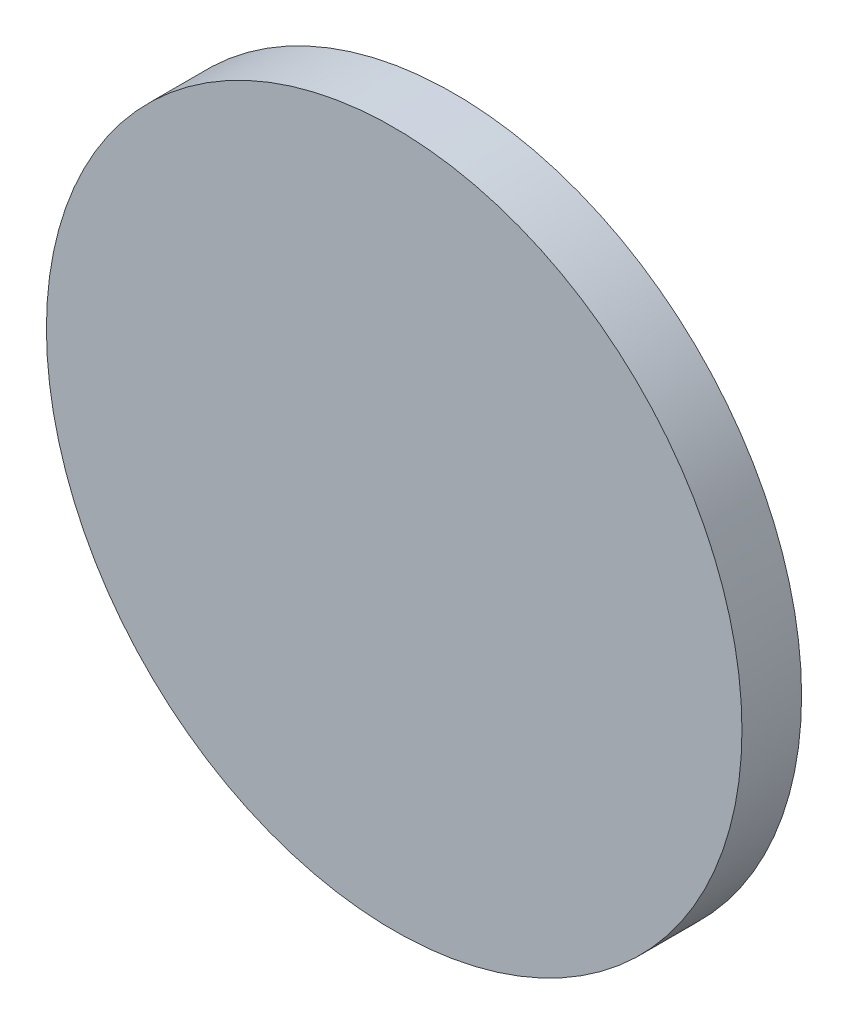
ISO-10303-21;
HEADER;
FILE_DESCRIPTION(('STEP AP214'),'2;1');
FILE_NAME('part.step','',(''),(''),'','','');
FILE_SCHEMA(('AUTOMOTIVE_DESIGN { 1 0 10303 214 1 1 1 1 }'));
ENDSEC;
DATA;
#1=APPLICATION_CONTEXT('core data for automotive mechanical design processes');
#2=APPLICATION_PROTOCOL_DEFINITION('international standard','automotive_design',2000,#1);
#3=PRODUCT_CONTEXT('',#1,'mechanical');
#4=PRODUCT('Part','Part','',(#3));
#5=PRODUCT_RELATED_PRODUCT_CATEGORY('part','',(#4));
#6=PRODUCT_DEFINITION_FORMATION('','',#4);
#7=PRODUCT_DEFINITION_CONTEXT('part definition',#1,'design');
#8=PRODUCT_DEFINITION('design','',#6,#7);
#9=PRODUCT_DEFINITION_SHAPE('','',#8);
#10=(LENGTH_UNIT() NAMED_UNIT(*) SI_UNIT(.MILLI.,.METRE.));
#11=(NAMED_UNIT(*) PLANE_ANGLE_UNIT() SI_UNIT($,.RADIAN.));
#12=(NAMED_UNIT(*) SI_UNIT($,.STERADIAN.) SOLID_ANGLE_UNIT());
#13=UNCERTAINTY_MEASURE_WITH_UNIT(LENGTH_MEASURE(1.E-05),#10,'distance_accuracy_value','');
#14=(GEOMETRIC_REPRESENTATION_CONTEXT(3) GLOBAL_UNCERTAINTY_ASSIGNED_CONTEXT((#13)) GLOBAL_UNIT_ASSIGNED_CONTEXT((#10,
#11,#12)) REPRESENTATION_CONTEXT('',''));
#15=CARTESIAN_POINT('',(0.,0.,0.));
#16=DIRECTION('',(0.,0.,1.));
#17=DIRECTION('',(1.,0.,0.));
#18=AXIS2_PLACEMENT_3D('',#15,#16,#17);
#19=CARTESIAN_POINT('',(11.60008,8.700000014875,0.76487));
#20=DIRECTION('',(0.,0.,-1.));
#21=DIRECTION('',(-1.,0.,0.));
#22=AXIS2_PLACEMENT_3D('',#19,#20,#21);
#23=PLANE('',#22);
#24=CARTESIAN_POINT('',(11.60008,8.700000014875,0.76487));
#25=DIRECTION('',(0.,0.,1.));
#26=DIRECTION('',(1.,0.,0.));
#27=AXIS2_PLACEMENT_3D('',#24,#25,#26);
#28=CIRCLE('',#27,0.200024667);
#29=CARTESIAN_POINT('',(11.800104667,8.700000014875,0.76487));
#30=VERTEX_POINT('',#29);
#31=EDGE_CURVE('E18',#30,#30,#28,.T.);
#32=ORIENTED_EDGE('',*,*,#31,.F.);
#33=EDGE_LOOP('',(#32));
#34=FACE_BOUND('',#33,.T.);
#35=ADVANCED_FACE('F15',(#34),#23,.T.);
#36=CARTESIAN_POINT('',(11.60008,8.700000014875,0.76487));
#37=DIRECTION('',(0.,0.,1.));
#38=DIRECTION('',(1.,0.,0.));
#39=AXIS2_PLACEMENT_3D('',#36,#37,#38);
#40=CYLINDRICAL_SURFACE('',#39,0.200024667);
#41=CARTESIAN_POINT('',(11.60008,8.700000014875,0.79916));
#42=DIRECTION('',(0.,0.,1.));
#43=DIRECTION('',(1.,0.,0.));
#44=AXIS2_PLACEMENT_3D('',#41,#42,#43);
#45=CIRCLE('',#44,0.200024667);
#46=CARTESIAN_POINT('',(11.800104667,8.700000014875,0.79916));
#47=VERTEX_POINT('',#46);
#48=EDGE_CURVE('E10',#47,#47,#45,.T.);
#49=ORIENTED_EDGE('',*,*,#48,.F.);
#50=EDGE_LOOP('',(#49));
#51=FACE_BOUND('',#50,.T.);
#52=ORIENTED_EDGE('',*,*,#31,.T.);
#53=EDGE_LOOP('',(#52));
#54=FACE_BOUND('',#53,.T.);
#55=ADVANCED_FACE('F27',(#51,#54),#40,.T.);
#56=CARTESIAN_POINT('',(11.60008,8.700000014875,0.79916));
#57=DIRECTION('',(0.,0.,1.));
#58=DIRECTION('',(1.,0.,0.));
#59=AXIS2_PLACEMENT_3D('',#56,#57,#58);
#60=PLANE('',#59);
#61=ORIENTED_EDGE('',*,*,#48,.T.);
#62=EDGE_LOOP('',(#61));
#63=FACE_BOUND('',#62,.T.);
#64=ADVANCED_FACE('F34',(#63),#60,.T.);
#65=CLOSED_SHELL('',(#35,#55,#64));
#66=MANIFOLD_SOLID_BREP('B1',#65);
#67=ADVANCED_BREP_SHAPE_REPRESENTATION('',(#18,#66),#14);
#68=SHAPE_DEFINITION_REPRESENTATION(#9,#67);
ENDSEC;
END-ISO-10303-21;
